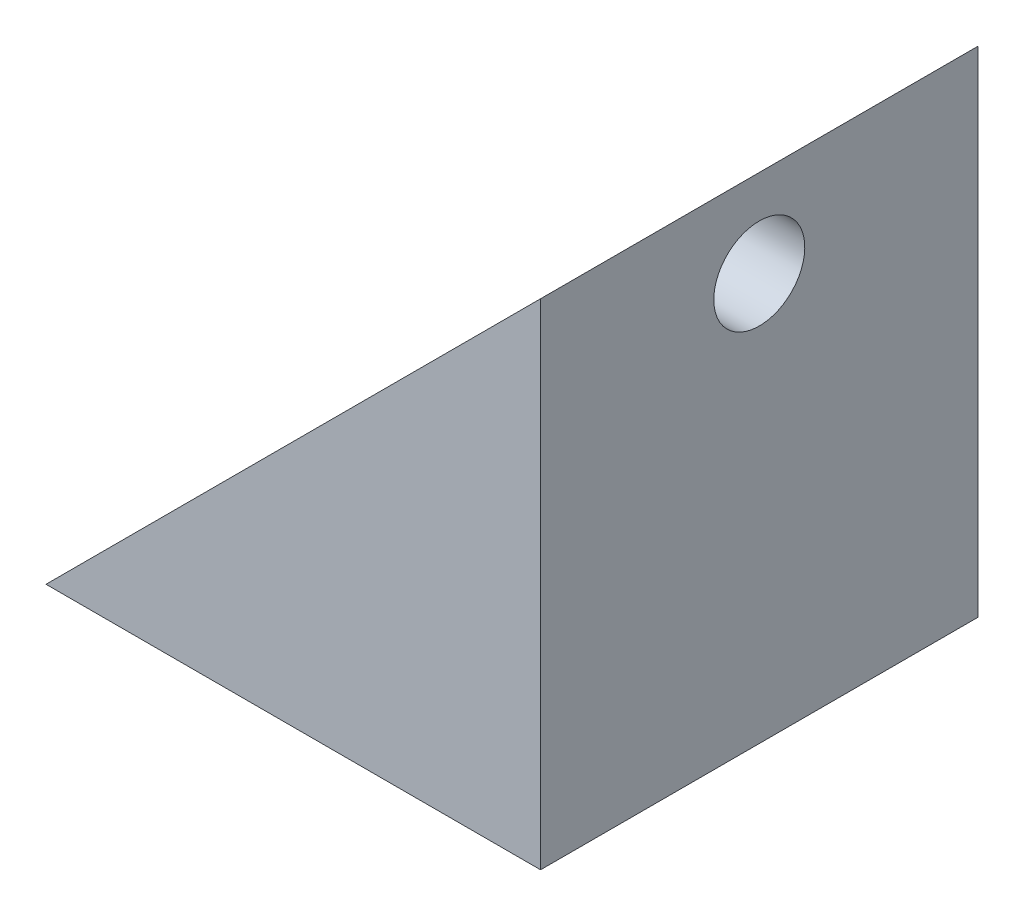
ISO-10303-21;
HEADER;
FILE_DESCRIPTION(('STEP AP214'),'2;1');
FILE_NAME('part.step','',(''),(''),'','','');
FILE_SCHEMA(('AUTOMOTIVE_DESIGN { 1 0 10303 214 1 1 1 1 }'));
ENDSEC;
DATA;
#1=APPLICATION_CONTEXT('core data for automotive mechanical design processes');
#2=APPLICATION_PROTOCOL_DEFINITION('international standard','automotive_design',2000,#1);
#3=PRODUCT_CONTEXT('',#1,'mechanical');
#4=PRODUCT('Part','Part','',(#3));
#5=PRODUCT_RELATED_PRODUCT_CATEGORY('part','',(#4));
#6=PRODUCT_DEFINITION_FORMATION('','',#4);
#7=PRODUCT_DEFINITION_CONTEXT('part definition',#1,'design');
#8=PRODUCT_DEFINITION('design','',#6,#7);
#9=PRODUCT_DEFINITION_SHAPE('','',#8);
#10=(LENGTH_UNIT() NAMED_UNIT(*) SI_UNIT(.MILLI.,.METRE.));
#11=(NAMED_UNIT(*) PLANE_ANGLE_UNIT() SI_UNIT($,.RADIAN.));
#12=(NAMED_UNIT(*) SI_UNIT($,.STERADIAN.) SOLID_ANGLE_UNIT());
#13=UNCERTAINTY_MEASURE_WITH_UNIT(LENGTH_MEASURE(1.E-05),#10,'distance_accuracy_value','');
#14=(GEOMETRIC_REPRESENTATION_CONTEXT(3) GLOBAL_UNCERTAINTY_ASSIGNED_CONTEXT((#13)) GLOBAL_UNIT_ASSIGNED_CONTEXT((#10,
#11,#12)) REPRESENTATION_CONTEXT('',''));
#15=CARTESIAN_POINT('',(0.,0.,0.));
#16=DIRECTION('',(0.,0.,1.));
#17=DIRECTION('',(1.,0.,0.));
#18=AXIS2_PLACEMENT_3D('',#15,#16,#17);
#19=CARTESIAN_POINT('',(28.2657287085678,0.,-25.));
#20=DIRECTION('',(0.,-1.,0.));
#21=DIRECTION('',(0.,0.,-1.));
#22=AXIS2_PLACEMENT_3D('',#19,#20,#21);
#23=PLANE('',#22);
#24=CARTESIAN_POINT('',(5.,0.,-12.5));
#25=DIRECTION('',(0.,-1.,0.));
#26=DIRECTION('',(0.,0.,-1.));
#27=AXIS2_PLACEMENT_3D('',#24,#25,#26);
#28=CIRCLE('',#27,2.6);
#29=CARTESIAN_POINT('',(5.,0.,-15.1));
#30=VERTEX_POINT('',#29);
#31=EDGE_CURVE('E123',#30,#30,#28,.T.);
#32=ORIENTED_EDGE('',*,*,#31,.F.);
#33=EDGE_LOOP('',(#32));
#34=FACE_BOUND('',#33,.T.);
#35=DIRECTION('',(1.,0.,0.));
#36=VECTOR('',#35,1.);
#37=CARTESIAN_POINT('',(28.2657287085678,0.,0.));
#38=LINE('',#37,#36);
#39=CARTESIAN_POINT('',(0.,0.,0.));
#40=VERTEX_POINT('',#39);
#41=CARTESIAN_POINT('',(28.2657287085678,0.,0.));
#42=VERTEX_POINT('',#41);
#43=EDGE_CURVE('E137',#40,#42,#38,.T.);
#44=ORIENTED_EDGE('',*,*,#43,.F.);
#45=DIRECTION('',(0.,0.,1.));
#46=VECTOR('',#45,1.);
#47=CARTESIAN_POINT('',(0.,0.,-25.));
#48=LINE('',#47,#46);
#49=CARTESIAN_POINT('',(0.,0.,-25.));
#50=VERTEX_POINT('',#49);
#51=EDGE_CURVE('E145',#50,#40,#48,.T.);
#52=ORIENTED_EDGE('',*,*,#51,.F.);
#53=DIRECTION('',(1.,0.,0.));
#54=VECTOR('',#53,1.);
#55=CARTESIAN_POINT('',(28.2657287085678,0.,-25.));
#56=LINE('',#55,#54);
#57=CARTESIAN_POINT('',(28.2657287085678,0.,-25.));
#58=VERTEX_POINT('',#57);
#59=EDGE_CURVE('E126',#50,#58,#56,.T.);
#60=ORIENTED_EDGE('',*,*,#59,.T.);
#61=DIRECTION('',(0.,0.,1.));
#62=VECTOR('',#61,1.);
#63=CARTESIAN_POINT('',(28.2657287085678,0.,-25.));
#64=LINE('',#63,#62);
#65=EDGE_CURVE('E136',#58,#42,#64,.T.);
#66=ORIENTED_EDGE('',*,*,#65,.T.);
#67=EDGE_LOOP('',(#44,#52,#60,#66));
#68=FACE_BOUND('',#67,.T.);
#69=ADVANCED_FACE('F41',(#34,#68),#23,.T.);
#70=CARTESIAN_POINT('',(0.,0.,-25.));
#71=DIRECTION('',(-0.707106781186544,0.707106781186551,0.));
#72=DIRECTION('',(-0.707106781186551,-0.707106781186544,0.));
#73=AXIS2_PLACEMENT_3D('',#70,#71,#72);
#74=PLANE('',#73);
#75=DIRECTION('',(0.,0.,1.));
#76=VECTOR('',#75,1.);
#77=CARTESIAN_POINT('',(4.00000000000004,4.,-25.));
#78=LINE('',#77,#76);
#79=CARTESIAN_POINT('',(4.00000000000004,4.,-17.908326913196));
#80=VERTEX_POINT('',#79);
#81=CARTESIAN_POINT('',(4.00000000000004,4.,-14.9));
#82=VERTEX_POINT('',#81);
#83=EDGE_CURVE('E55',#80,#82,#78,.T.);
#84=ORIENTED_EDGE('',*,*,#83,.F.);
#85=CARTESIAN_POINT('',(5.,4.99999999999995,-12.5));
#86=DIRECTION('',(-0.707106781186544,0.707106781186551,0.));
#87=DIRECTION('',(-0.707106781186551,-0.707106781186544,0.));
#88=AXIS2_PLACEMENT_3D('',#85,#86,#87);
#89=ELLIPSE('',#88,7.77817459305198,5.5);
#90=CARTESIAN_POINT('',(4.00000000000004,4.,-7.09167308680401));
#91=VERTEX_POINT('',#90);
#92=EDGE_CURVE('E11',#91,#80,#89,.T.);
#93=ORIENTED_EDGE('',*,*,#92,.F.);
#94=CARTESIAN_POINT('',(4.00000000000004,4.,-10.1));
#95=VERTEX_POINT('',#94);
#96=EDGE_CURVE('E98',#95,#91,#78,.T.);
#97=ORIENTED_EDGE('',*,*,#96,.F.);
#98=CARTESIAN_POINT('',(5.,4.99999999999995,-12.5));
#99=DIRECTION('',(-0.707106781186544,0.707106781186551,0.));
#100=DIRECTION('',(-0.707106781186551,-0.707106781186544,0.));
#101=AXIS2_PLACEMENT_3D('',#98,#99,#100);
#102=ELLIPSE('',#101,3.67695526217003,2.6);
#103=EDGE_CURVE('E112',#82,#95,#102,.T.);
#104=ORIENTED_EDGE('',*,*,#103,.F.);
#105=EDGE_LOOP('',(#84,#93,#97,#104));
#106=FACE_BOUND('',#105,.T.);
#107=DIRECTION('',(0.,0.,-1.));
#108=VECTOR('',#107,1.);
#109=CARTESIAN_POINT('',(24.2657287085677,24.2657287085675,-25.));
#110=LINE('',#109,#108);
#111=CARTESIAN_POINT('',(24.2657287085677,24.2657287085675,-7.09167308680402));
#112=VERTEX_POINT('',#111);
#113=CARTESIAN_POINT('',(24.2657287085677,24.2657287085675,-10.1));
#114=VERTEX_POINT('',#113);
#115=EDGE_CURVE('E63',#112,#114,#110,.T.);
#116=ORIENTED_EDGE('',*,*,#115,.F.);
#117=CARTESIAN_POINT('',(23.2657287085677,23.2657287085675,-12.5));
#118=DIRECTION('',(-0.707106781186544,0.707106781186551,0.));
#119=DIRECTION('',(0.707106781186551,0.707106781186544,0.));
#120=AXIS2_PLACEMENT_3D('',#117,#118,#119);
#121=ELLIPSE('',#120,7.77817459305206,5.5);
#122=CARTESIAN_POINT('',(24.2657287085677,24.2657287085675,-17.908326913196));
#123=VERTEX_POINT('',#122);
#124=EDGE_CURVE('E155',#123,#112,#121,.T.);
#125=ORIENTED_EDGE('',*,*,#124,.F.);
#126=CARTESIAN_POINT('',(24.2657287085677,24.2657287085675,-14.9));
#127=VERTEX_POINT('',#126);
#128=EDGE_CURVE('E115',#127,#123,#110,.T.);
#129=ORIENTED_EDGE('',*,*,#128,.F.);
#130=CARTESIAN_POINT('',(23.2657287085677,23.2657287085675,-12.5));
#131=DIRECTION('',(-0.707106781186544,0.707106781186551,0.));
#132=DIRECTION('',(0.707106781186551,0.707106781186544,0.));
#133=AXIS2_PLACEMENT_3D('',#130,#131,#132);
#134=ELLIPSE('',#133,3.67695526217007,2.6);
#135=EDGE_CURVE('E119',#127,#114,#134,.F.);
#136=ORIENTED_EDGE('',*,*,#135,.T.);
#137=EDGE_LOOP('',(#116,#125,#129,#136));
#138=FACE_BOUND('',#137,.T.);
#139=DIRECTION('',(-0.707106781186551,-0.707106781186544,0.));
#140=VECTOR('',#139,1.);
#141=CARTESIAN_POINT('',(0.,0.,0.));
#142=LINE('',#141,#140);
#143=CARTESIAN_POINT('',(28.2657287085678,28.2657287085675,0.));
#144=VERTEX_POINT('',#143);
#145=EDGE_CURVE('E130',#144,#40,#142,.T.);
#146=ORIENTED_EDGE('',*,*,#145,.F.);
#147=DIRECTION('',(0.,0.,1.));
#148=VECTOR('',#147,1.);
#149=CARTESIAN_POINT('',(28.2657287085678,28.2657287085675,-25.));
#150=LINE('',#149,#148);
#151=CARTESIAN_POINT('',(28.2657287085678,28.2657287085675,-25.));
#152=VERTEX_POINT('',#151);
#153=EDGE_CURVE('E148',#152,#144,#150,.T.);
#154=ORIENTED_EDGE('',*,*,#153,.F.);
#155=DIRECTION('',(-0.707106781186551,-0.707106781186544,0.));
#156=VECTOR('',#155,1.);
#157=CARTESIAN_POINT('',(0.,0.,-25.));
#158=LINE('',#157,#156);
#159=EDGE_CURVE('E133',#152,#50,#158,.T.);
#160=ORIENTED_EDGE('',*,*,#159,.T.);
#161=ORIENTED_EDGE('',*,*,#51,.T.);
#162=EDGE_LOOP('',(#146,#154,#160,#161));
#163=FACE_BOUND('',#162,.T.);
#164=ADVANCED_FACE('F110',(#106,#138,#163),#74,.T.);
#165=CARTESIAN_POINT('',(28.2657287085678,28.2657287085675,-25.));
#166=DIRECTION('',(1.,0.,0.));
#167=DIRECTION('',(0.,1.,0.));
#168=AXIS2_PLACEMENT_3D('',#165,#166,#167);
#169=PLANE('',#168);
#170=CARTESIAN_POINT('',(28.2657287085678,23.2657287085675,-12.5));
#171=DIRECTION('',(1.,0.,0.));
#172=DIRECTION('',(0.,1.,0.));
#173=AXIS2_PLACEMENT_3D('',#170,#171,#172);
#174=CIRCLE('',#173,2.6);
#175=CARTESIAN_POINT('',(28.2657287085678,25.8657287085675,-12.5));
#176=VERTEX_POINT('',#175);
#177=EDGE_CURVE('E122',#176,#176,#174,.T.);
#178=ORIENTED_EDGE('',*,*,#177,.F.);
#179=EDGE_LOOP('',(#178));
#180=FACE_BOUND('',#179,.T.);
#181=DIRECTION('',(0.,1.,0.));
#182=VECTOR('',#181,1.);
#183=CARTESIAN_POINT('',(28.2657287085678,28.2657287085675,0.));
#184=LINE('',#183,#182);
#185=EDGE_CURVE('E140',#42,#144,#184,.T.);
#186=ORIENTED_EDGE('',*,*,#185,.F.);
#187=ORIENTED_EDGE('',*,*,#65,.F.);
#188=DIRECTION('',(0.,1.,0.));
#189=VECTOR('',#188,1.);
#190=CARTESIAN_POINT('',(28.2657287085678,28.2657287085675,-25.));
#191=LINE('',#190,#189);
#192=EDGE_CURVE('E129',#58,#152,#191,.T.);
#193=ORIENTED_EDGE('',*,*,#192,.T.);
#194=ORIENTED_EDGE('',*,*,#153,.T.);
#195=EDGE_LOOP('',(#186,#187,#193,#194));
#196=FACE_BOUND('',#195,.T.);
#197=ADVANCED_FACE('F178',(#180,#196),#169,.T.);
#198=CARTESIAN_POINT('',(0.,0.,-25.));
#199=DIRECTION('',(0.,0.,1.));
#200=DIRECTION('',(1.,0.,0.));
#201=AXIS2_PLACEMENT_3D('',#198,#199,#200);
#202=PLANE('',#201);
#203=ORIENTED_EDGE('',*,*,#59,.F.);
#204=ORIENTED_EDGE('',*,*,#159,.F.);
#205=ORIENTED_EDGE('',*,*,#192,.F.);
#206=EDGE_LOOP('',(#203,#204,#205));
#207=FACE_BOUND('',#206,.T.);
#208=ADVANCED_FACE('F176',(#207),#202,.F.);
#209=CARTESIAN_POINT('',(0.,0.,0.));
#210=DIRECTION('',(0.,0.,1.));
#211=DIRECTION('',(1.,0.,0.));
#212=AXIS2_PLACEMENT_3D('',#209,#210,#211);
#213=PLANE('',#212);
#214=ORIENTED_EDGE('',*,*,#43,.T.);
#215=ORIENTED_EDGE('',*,*,#185,.T.);
#216=ORIENTED_EDGE('',*,*,#145,.T.);
#217=EDGE_LOOP('',(#214,#215,#216));
#218=FACE_BOUND('',#217,.T.);
#219=ADVANCED_FACE('F161',(#218),#213,.T.);
#220=CARTESIAN_POINT('',(5.,28.2657287085675,-12.5));
#221=DIRECTION('',(0.,-1.,0.));
#222=DIRECTION('',(0.,0.,-1.));
#223=AXIS2_PLACEMENT_3D('',#220,#221,#222);
#224=CYLINDRICAL_SURFACE('',#223,2.6);
#225=ORIENTED_EDGE('',*,*,#103,.T.);
#226=CARTESIAN_POINT('',(5.,4.,-12.5));
#227=DIRECTION('',(0.,-1.,0.));
#228=DIRECTION('',(0.,0.,-1.));
#229=AXIS2_PLACEMENT_3D('',#226,#227,#228);
#230=CIRCLE('',#229,2.6);
#231=EDGE_CURVE('E48',#95,#82,#230,.F.);
#232=ORIENTED_EDGE('',*,*,#231,.T.);
#233=EDGE_LOOP('',(#225,#232));
#234=FACE_BOUND('',#233,.T.);
#235=ORIENTED_EDGE('',*,*,#31,.T.);
#236=EDGE_LOOP('',(#235));
#237=FACE_BOUND('',#236,.T.);
#238=ADVANCED_FACE('F157',(#234,#237),#224,.F.);
#239=CARTESIAN_POINT('',(14.3887734463977,23.2657287085675,-12.5));
#240=DIRECTION('',(1.,0.,0.));
#241=DIRECTION('',(0.,1.,0.));
#242=AXIS2_PLACEMENT_3D('',#239,#240,#241);
#243=CYLINDRICAL_SURFACE('',#242,2.6);
#244=ORIENTED_EDGE('',*,*,#177,.T.);
#245=EDGE_LOOP('',(#244));
#246=FACE_BOUND('',#245,.T.);
#247=ORIENTED_EDGE('',*,*,#135,.F.);
#248=CARTESIAN_POINT('',(24.2657287085677,23.2657287085675,-12.5));
#249=DIRECTION('',(1.,0.,0.));
#250=DIRECTION('',(0.,1.,0.));
#251=AXIS2_PLACEMENT_3D('',#248,#249,#250);
#252=CIRCLE('',#251,2.6);
#253=EDGE_CURVE('E147',#127,#114,#252,.F.);
#254=ORIENTED_EDGE('',*,*,#253,.T.);
#255=EDGE_LOOP('',(#247,#254));
#256=FACE_BOUND('',#255,.T.);
#257=ADVANCED_FACE('F160',(#246,#256),#243,.F.);
#258=CARTESIAN_POINT('',(0.,23.2657287085675,-12.5));
#259=DIRECTION('',(1.,0.,0.));
#260=DIRECTION('',(0.,0.,-1.));
#261=AXIS2_PLACEMENT_3D('',#258,#259,#260);
#262=CYLINDRICAL_SURFACE('',#261,5.5);
#263=ORIENTED_EDGE('',*,*,#124,.T.);
#264=CARTESIAN_POINT('',(24.2657287085677,23.2657287085675,-12.5));
#265=DIRECTION('',(1.,0.,0.));
#266=DIRECTION('',(0.,1.,0.));
#267=AXIS2_PLACEMENT_3D('',#264,#265,#266);
#268=CIRCLE('',#267,5.5);
#269=EDGE_CURVE('E113',#112,#123,#268,.T.);
#270=ORIENTED_EDGE('',*,*,#269,.T.);
#271=EDGE_LOOP('',(#263,#270));
#272=FACE_BOUND('',#271,.T.);
#273=ADVANCED_FACE('F193',(#272),#262,.F.);
#274=CARTESIAN_POINT('',(24.2657287085677,23.2657287085675,-12.5));
#275=DIRECTION('',(1.,0.,0.));
#276=DIRECTION('',(0.,1.,0.));
#277=AXIS2_PLACEMENT_3D('',#274,#275,#276);
#278=PLANE('',#277);
#279=ORIENTED_EDGE('',*,*,#115,.T.);
#280=ORIENTED_EDGE('',*,*,#253,.F.);
#281=ORIENTED_EDGE('',*,*,#128,.T.);
#282=ORIENTED_EDGE('',*,*,#269,.F.);
#283=EDGE_LOOP('',(#279,#280,#281,#282));
#284=FACE_BOUND('',#283,.T.);
#285=ADVANCED_FACE('F197',(#284),#278,.F.);
#286=CARTESIAN_POINT('',(5.,28.2657287085675,-12.5));
#287=DIRECTION('',(0.,-1.,0.));
#288=DIRECTION('',(0.,0.,-1.));
#289=AXIS2_PLACEMENT_3D('',#286,#287,#288);
#290=CYLINDRICAL_SURFACE('',#289,5.5);
#291=ORIENTED_EDGE('',*,*,#92,.T.);
#292=CARTESIAN_POINT('',(5.,4.,-12.5));
#293=DIRECTION('',(0.,-1.,0.));
#294=DIRECTION('',(0.,0.,-1.));
#295=AXIS2_PLACEMENT_3D('',#292,#293,#294);
#296=CIRCLE('',#295,5.5);
#297=EDGE_CURVE('E101',#80,#91,#296,.T.);
#298=ORIENTED_EDGE('',*,*,#297,.T.);
#299=EDGE_LOOP('',(#291,#298));
#300=FACE_BOUND('',#299,.T.);
#301=ADVANCED_FACE('F108',(#300),#290,.F.);
#302=CARTESIAN_POINT('',(5.,4.,-12.5));
#303=DIRECTION('',(0.,-1.,0.));
#304=DIRECTION('',(0.,0.,-1.));
#305=AXIS2_PLACEMENT_3D('',#302,#303,#304);
#306=PLANE('',#305);
#307=ORIENTED_EDGE('',*,*,#83,.T.);
#308=ORIENTED_EDGE('',*,*,#231,.F.);
#309=ORIENTED_EDGE('',*,*,#96,.T.);
#310=ORIENTED_EDGE('',*,*,#297,.F.);
#311=EDGE_LOOP('',(#307,#308,#309,#310));
#312=FACE_BOUND('',#311,.T.);
#313=ADVANCED_FACE('F100',(#312),#306,.F.);
#314=CLOSED_SHELL('',(#69,#164,#197,#208,#219,#238,#257,#273,#285,#301,#313));
#315=MANIFOLD_SOLID_BREP('B2',#314);
#316=ADVANCED_BREP_SHAPE_REPRESENTATION('',(#18,#315),#14);
#317=SHAPE_DEFINITION_REPRESENTATION(#9,#316);
ENDSEC;
END-ISO-10303-21;
